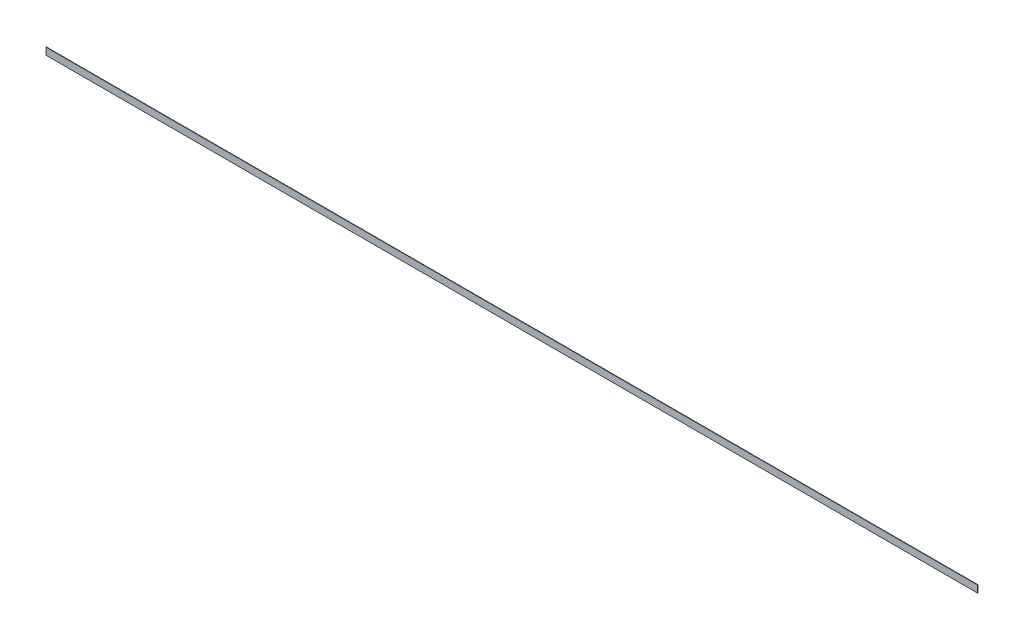
ISO-10303-21;
HEADER;
FILE_DESCRIPTION(('STEP AP214'),'2;1');
FILE_NAME('part.step','',(''),(''),'','','');
FILE_SCHEMA(('AUTOMOTIVE_DESIGN { 1 0 10303 214 1 1 1 1 }'));
ENDSEC;
DATA;
#1=APPLICATION_CONTEXT('core data for automotive mechanical design processes');
#2=APPLICATION_PROTOCOL_DEFINITION('international standard','automotive_design',2000,#1);
#3=PRODUCT_CONTEXT('',#1,'mechanical');
#4=PRODUCT('Part','Part','',(#3));
#5=PRODUCT_RELATED_PRODUCT_CATEGORY('part','',(#4));
#6=PRODUCT_DEFINITION_FORMATION('','',#4);
#7=PRODUCT_DEFINITION_CONTEXT('part definition',#1,'design');
#8=PRODUCT_DEFINITION('design','',#6,#7);
#9=PRODUCT_DEFINITION_SHAPE('','',#8);
#10=(LENGTH_UNIT() NAMED_UNIT(*) SI_UNIT(.MILLI.,.METRE.));
#11=(NAMED_UNIT(*) PLANE_ANGLE_UNIT() SI_UNIT($,.RADIAN.));
#12=(NAMED_UNIT(*) SI_UNIT($,.STERADIAN.) SOLID_ANGLE_UNIT());
#13=UNCERTAINTY_MEASURE_WITH_UNIT(LENGTH_MEASURE(1.E-05),#10,'distance_accuracy_value','');
#14=(GEOMETRIC_REPRESENTATION_CONTEXT(3) GLOBAL_UNCERTAINTY_ASSIGNED_CONTEXT((#13)) GLOBAL_UNIT_ASSIGNED_CONTEXT((#10,
#11,#12)) REPRESENTATION_CONTEXT('',''));
#15=CARTESIAN_POINT('',(0.,0.,0.));
#16=DIRECTION('',(0.,0.,1.));
#17=DIRECTION('',(1.,0.,0.));
#18=AXIS2_PLACEMENT_3D('',#15,#16,#17);
#19=CARTESIAN_POINT('',(-3375.025,-25.4,-3.175));
#20=DIRECTION('',(0.,0.,-1.));
#21=DIRECTION('',(-1.,0.,0.));
#22=AXIS2_PLACEMENT_3D('',#19,#20,#21);
#23=PLANE('',#22);
#24=DIRECTION('',(1.,0.,0.));
#25=VECTOR('',#24,1.);
#26=CARTESIAN_POINT('',(-3375.025,-25.4,-3.175));
#27=LINE('',#26,#25);
#28=CARTESIAN_POINT('',(-3375.025,-25.4,-3.175));
#29=VERTEX_POINT('',#28);
#30=CARTESIAN_POINT('',(3375.025,-25.4,-3.175));
#31=VERTEX_POINT('',#30);
#32=EDGE_CURVE('E20',#29,#31,#27,.T.);
#33=ORIENTED_EDGE('',*,*,#32,.F.);
#34=DIRECTION('',(0.,1.,0.));
#35=VECTOR('',#34,1.);
#36=CARTESIAN_POINT('',(-3375.025,0.,-3.175));
#37=LINE('',#36,#35);
#38=CARTESIAN_POINT('',(-3375.025,25.4,-3.175));
#39=VERTEX_POINT('',#38);
#40=EDGE_CURVE('E80',#29,#39,#37,.T.);
#41=ORIENTED_EDGE('',*,*,#40,.T.);
#42=DIRECTION('',(1.,0.,0.));
#43=VECTOR('',#42,1.);
#44=CARTESIAN_POINT('',(-3375.025,25.4,-3.175));
#45=LINE('',#44,#43);
#46=CARTESIAN_POINT('',(3375.025,25.4,-3.175));
#47=VERTEX_POINT('',#46);
#48=EDGE_CURVE('E68',#47,#39,#45,.F.);
#49=ORIENTED_EDGE('',*,*,#48,.F.);
#50=DIRECTION('',(0.,1.,0.));
#51=VECTOR('',#50,1.);
#52=CARTESIAN_POINT('',(3375.025,0.,-3.175));
#53=LINE('',#52,#51);
#54=EDGE_CURVE('E56',#31,#47,#53,.T.);
#55=ORIENTED_EDGE('',*,*,#54,.F.);
#56=EDGE_LOOP('',(#33,#41,#49,#55));
#57=FACE_BOUND('',#56,.T.);
#58=ADVANCED_FACE('F17',(#57),#23,.T.);
#59=CARTESIAN_POINT('',(-3375.025,-25.4,0.));
#60=DIRECTION('',(0.,-1.,0.));
#61=DIRECTION('',(0.,0.,-1.));
#62=AXIS2_PLACEMENT_3D('',#59,#60,#61);
#63=PLANE('',#62);
#64=DIRECTION('',(1.,0.,0.));
#65=VECTOR('',#64,1.);
#66=CARTESIAN_POINT('',(-3375.025,-25.4,0.));
#67=LINE('',#66,#65);
#68=CARTESIAN_POINT('',(-3375.025,-25.4,0.));
#69=VERTEX_POINT('',#68);
#70=CARTESIAN_POINT('',(3375.025,-25.4,0.));
#71=VERTEX_POINT('',#70);
#72=EDGE_CURVE('E83',#69,#71,#67,.T.);
#73=ORIENTED_EDGE('',*,*,#72,.F.);
#74=DIRECTION('',(0.,0.,-1.));
#75=VECTOR('',#74,1.);
#76=CARTESIAN_POINT('',(-3375.025,-25.4,0.));
#77=LINE('',#76,#75);
#78=EDGE_CURVE('E65',#69,#29,#77,.T.);
#79=ORIENTED_EDGE('',*,*,#78,.T.);
#80=ORIENTED_EDGE('',*,*,#32,.T.);
#81=DIRECTION('',(0.,0.,-1.));
#82=VECTOR('',#81,1.);
#83=CARTESIAN_POINT('',(3375.025,-25.4,0.));
#84=LINE('',#83,#82);
#85=EDGE_CURVE('E62',#71,#31,#84,.T.);
#86=ORIENTED_EDGE('',*,*,#85,.F.);
#87=EDGE_LOOP('',(#73,#79,#80,#86));
#88=FACE_BOUND('',#87,.T.);
#89=ADVANCED_FACE('F61',(#88),#63,.T.);
#90=CARTESIAN_POINT('',(3375.025,0.,0.));
#91=DIRECTION('',(1.,0.,0.));
#92=DIRECTION('',(0.,0.,-1.));
#93=AXIS2_PLACEMENT_3D('',#90,#91,#92);
#94=PLANE('',#93);
#95=DIRECTION('',(0.,0.,1.));
#96=VECTOR('',#95,1.);
#97=CARTESIAN_POINT('',(3375.025,25.4,-3.175));
#98=LINE('',#97,#96);
#99=CARTESIAN_POINT('',(3375.025,25.4,0.));
#100=VERTEX_POINT('',#99);
#101=EDGE_CURVE('E70',#100,#47,#98,.F.);
#102=ORIENTED_EDGE('',*,*,#101,.F.);
#103=DIRECTION('',(0.,1.,0.));
#104=VECTOR('',#103,1.);
#105=CARTESIAN_POINT('',(3375.025,25.4,0.));
#106=LINE('',#105,#104);
#107=EDGE_CURVE('E74',#71,#100,#106,.T.);
#108=ORIENTED_EDGE('',*,*,#107,.F.);
#109=ORIENTED_EDGE('',*,*,#85,.T.);
#110=ORIENTED_EDGE('',*,*,#54,.T.);
#111=EDGE_LOOP('',(#102,#108,#109,#110));
#112=FACE_BOUND('',#111,.T.);
#113=ADVANCED_FACE('F72',(#112),#94,.T.);
#114=CARTESIAN_POINT('',(-3375.025,25.4,-3.175));
#115=DIRECTION('',(0.,1.,0.));
#116=DIRECTION('',(0.,0.,1.));
#117=AXIS2_PLACEMENT_3D('',#114,#115,#116);
#118=PLANE('',#117);
#119=ORIENTED_EDGE('',*,*,#48,.T.);
#120=DIRECTION('',(0.,0.,-1.));
#121=VECTOR('',#120,1.);
#122=CARTESIAN_POINT('',(-3375.025,25.4,0.));
#123=LINE('',#122,#121);
#124=CARTESIAN_POINT('',(-3375.025,25.4,0.));
#125=VERTEX_POINT('',#124);
#126=EDGE_CURVE('E35',#39,#125,#123,.F.);
#127=ORIENTED_EDGE('',*,*,#126,.T.);
#128=DIRECTION('',(1.,0.,0.));
#129=VECTOR('',#128,1.);
#130=CARTESIAN_POINT('',(-3375.025,25.4,0.));
#131=LINE('',#130,#129);
#132=EDGE_CURVE('E26',#100,#125,#131,.F.);
#133=ORIENTED_EDGE('',*,*,#132,.F.);
#134=ORIENTED_EDGE('',*,*,#101,.T.);
#135=EDGE_LOOP('',(#119,#127,#133,#134));
#136=FACE_BOUND('',#135,.T.);
#137=ADVANCED_FACE('F89',(#136),#118,.T.);
#138=CARTESIAN_POINT('',(-3375.025,0.,0.));
#139=DIRECTION('',(1.,0.,0.));
#140=DIRECTION('',(0.,0.,-1.));
#141=AXIS2_PLACEMENT_3D('',#138,#139,#140);
#142=PLANE('',#141);
#143=ORIENTED_EDGE('',*,*,#40,.F.);
#144=ORIENTED_EDGE('',*,*,#78,.F.);
#145=DIRECTION('',(0.,1.,0.));
#146=VECTOR('',#145,1.);
#147=CARTESIAN_POINT('',(-3375.025,25.4,0.));
#148=LINE('',#147,#146);
#149=EDGE_CURVE('E11',#125,#69,#148,.F.);
#150=ORIENTED_EDGE('',*,*,#149,.F.);
#151=ORIENTED_EDGE('',*,*,#126,.F.);
#152=EDGE_LOOP('',(#143,#144,#150,#151));
#153=FACE_BOUND('',#152,.T.);
#154=ADVANCED_FACE('F91',(#153),#142,.F.);
#155=CARTESIAN_POINT('',(-3375.025,25.4,0.));
#156=DIRECTION('',(0.,0.,1.));
#157=DIRECTION('',(1.,0.,0.));
#158=AXIS2_PLACEMENT_3D('',#155,#156,#157);
#159=PLANE('',#158);
#160=ORIENTED_EDGE('',*,*,#132,.T.);
#161=ORIENTED_EDGE('',*,*,#149,.T.);
#162=ORIENTED_EDGE('',*,*,#72,.T.);
#163=ORIENTED_EDGE('',*,*,#107,.T.);
#164=EDGE_LOOP('',(#160,#161,#162,#163));
#165=FACE_BOUND('',#164,.T.);
#166=ADVANCED_FACE('F88',(#165),#159,.T.);
#167=CLOSED_SHELL('',(#58,#89,#113,#137,#154,#166));
#168=MANIFOLD_SOLID_BREP('B1',#167);
#169=ADVANCED_BREP_SHAPE_REPRESENTATION('',(#18,#168),#14);
#170=SHAPE_DEFINITION_REPRESENTATION(#9,#169);
ENDSEC;
END-ISO-10303-21;
